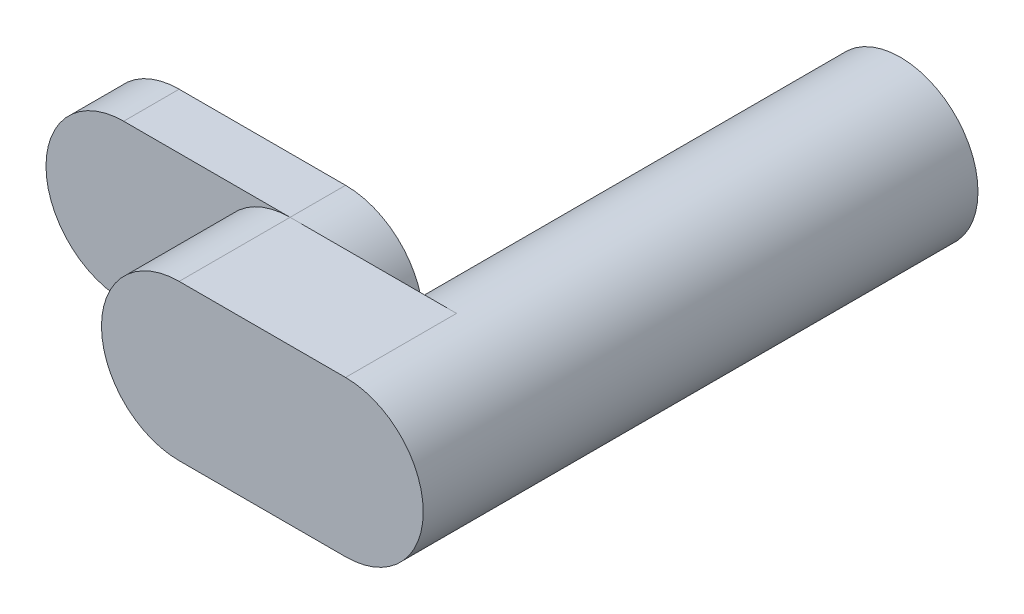
ISO-10303-21;
HEADER;
FILE_DESCRIPTION(('STEP AP214'),'2;1');
FILE_NAME('part.step','',(''),(''),'','','');
FILE_SCHEMA(('AUTOMOTIVE_DESIGN { 1 0 10303 214 1 1 1 1 }'));
ENDSEC;
DATA;
#1=APPLICATION_CONTEXT('core data for automotive mechanical design processes');
#2=APPLICATION_PROTOCOL_DEFINITION('international standard','automotive_design',2000,#1);
#3=PRODUCT_CONTEXT('',#1,'mechanical');
#4=PRODUCT('Part','Part','',(#3));
#5=PRODUCT_RELATED_PRODUCT_CATEGORY('part','',(#4));
#6=PRODUCT_DEFINITION_FORMATION('','',#4);
#7=PRODUCT_DEFINITION_CONTEXT('part definition',#1,'design');
#8=PRODUCT_DEFINITION('design','',#6,#7);
#9=PRODUCT_DEFINITION_SHAPE('','',#8);
#10=(LENGTH_UNIT() NAMED_UNIT(*) SI_UNIT(.MILLI.,.METRE.));
#11=(NAMED_UNIT(*) PLANE_ANGLE_UNIT() SI_UNIT($,.RADIAN.));
#12=(NAMED_UNIT(*) SI_UNIT($,.STERADIAN.) SOLID_ANGLE_UNIT());
#13=UNCERTAINTY_MEASURE_WITH_UNIT(LENGTH_MEASURE(1.E-05),#10,'distance_accuracy_value','');
#14=(GEOMETRIC_REPRESENTATION_CONTEXT(3) GLOBAL_UNCERTAINTY_ASSIGNED_CONTEXT((#13)) GLOBAL_UNIT_ASSIGNED_CONTEXT((#10,
#11,#12)) REPRESENTATION_CONTEXT('',''));
#15=CARTESIAN_POINT('',(0.,0.,0.));
#16=DIRECTION('',(0.,0.,1.));
#17=DIRECTION('',(1.,0.,0.));
#18=AXIS2_PLACEMENT_3D('',#15,#16,#17);
#19=CARTESIAN_POINT('',(0.,0.,400.));
#20=DIRECTION('',(0.,0.,1.));
#21=DIRECTION('',(1.,0.,0.));
#22=AXIS2_PLACEMENT_3D('',#19,#20,#21);
#23=PLANE('',#22);
#24=CARTESIAN_POINT('',(-150.,0.,400.));
#25=DIRECTION('',(0.,0.,-1.));
#26=DIRECTION('',(-1.,0.,0.));
#27=AXIS2_PLACEMENT_3D('',#24,#25,#26);
#28=CIRCLE('',#27,70.);
#29=CARTESIAN_POINT('',(-150.,70.,400.));
#30=VERTEX_POINT('',#29);
#31=CARTESIAN_POINT('',(-150.,-70.,400.));
#32=VERTEX_POINT('',#31);
#33=EDGE_CURVE('E69',#30,#32,#28,.T.);
#34=ORIENTED_EDGE('',*,*,#33,.F.);
#35=DIRECTION('',(-1.,0.,0.));
#36=VECTOR('',#35,1.);
#37=CARTESIAN_POINT('',(0.,70.,400.));
#38=LINE('',#37,#36);
#39=CARTESIAN_POINT('',(0.,70.,400.));
#40=VERTEX_POINT('',#39);
#41=EDGE_CURVE('E120',#40,#30,#38,.T.);
#42=ORIENTED_EDGE('',*,*,#41,.F.);
#43=CARTESIAN_POINT('',(0.,0.,400.));
#44=DIRECTION('',(0.,0.,1.));
#45=DIRECTION('',(1.,0.,0.));
#46=AXIS2_PLACEMENT_3D('',#43,#44,#45);
#47=CIRCLE('',#46,70.);
#48=CARTESIAN_POINT('',(0.,-70.,400.));
#49=VERTEX_POINT('',#48);
#50=EDGE_CURVE('E11',#40,#49,#47,.T.);
#51=ORIENTED_EDGE('',*,*,#50,.T.);
#52=DIRECTION('',(1.,0.,0.));
#53=VECTOR('',#52,1.);
#54=CARTESIAN_POINT('',(0.,-70.,400.));
#55=LINE('',#54,#53);
#56=EDGE_CURVE('E131',#32,#49,#55,.T.);
#57=ORIENTED_EDGE('',*,*,#56,.F.);
#58=EDGE_LOOP('',(#34,#42,#51,#57));
#59=FACE_BOUND('',#58,.T.);
#60=ADVANCED_FACE('F32',(#59),#23,.F.);
#61=CARTESIAN_POINT('',(0.,0.,400.));
#62=DIRECTION('',(0.,0.,-1.));
#63=DIRECTION('',(-1.,0.,0.));
#64=AXIS2_PLACEMENT_3D('',#61,#62,#63);
#65=CYLINDRICAL_SURFACE('',#64,70.);
#66=ORIENTED_EDGE('',*,*,#50,.F.);
#67=DIRECTION('',(0.,0.,-1.));
#68=VECTOR('',#67,1.);
#69=CARTESIAN_POINT('',(0.,70.,500.));
#70=LINE('',#69,#68);
#71=CARTESIAN_POINT('',(0.,70.,500.));
#72=VERTEX_POINT('',#71);
#73=EDGE_CURVE('E148',#72,#40,#70,.T.);
#74=ORIENTED_EDGE('',*,*,#73,.F.);
#75=CARTESIAN_POINT('',(0.,0.,500.));
#76=DIRECTION('',(0.,0.,1.));
#77=DIRECTION('',(1.,0.,0.));
#78=AXIS2_PLACEMENT_3D('',#75,#76,#77);
#79=CIRCLE('',#78,70.);
#80=CARTESIAN_POINT('',(0.,-70.,500.));
#81=VERTEX_POINT('',#80);
#82=EDGE_CURVE('E129',#81,#72,#79,.T.);
#83=ORIENTED_EDGE('',*,*,#82,.F.);
#84=DIRECTION('',(0.,0.,-1.));
#85=VECTOR('',#84,1.);
#86=CARTESIAN_POINT('',(0.,-70.,500.));
#87=LINE('',#86,#85);
#88=EDGE_CURVE('E135',#81,#49,#87,.T.);
#89=ORIENTED_EDGE('',*,*,#88,.T.);
#90=EDGE_LOOP('',(#66,#74,#83,#89));
#91=FACE_BOUND('',#90,.T.);
#92=CARTESIAN_POINT('',(0.,0.,0.));
#93=DIRECTION('',(0.,0.,1.));
#94=DIRECTION('',(1.,0.,0.));
#95=AXIS2_PLACEMENT_3D('',#92,#93,#94);
#96=CIRCLE('',#95,70.);
#97=CARTESIAN_POINT('',(70.,0.,0.));
#98=VERTEX_POINT('',#97);
#99=EDGE_CURVE('E36',#98,#98,#96,.T.);
#100=ORIENTED_EDGE('',*,*,#99,.T.);
#101=EDGE_LOOP('',(#100));
#102=FACE_BOUND('',#101,.T.);
#103=ADVANCED_FACE('F34',(#91,#102),#65,.T.);
#104=CARTESIAN_POINT('',(0.,0.,0.));
#105=DIRECTION('',(0.,0.,1.));
#106=DIRECTION('',(1.,0.,0.));
#107=AXIS2_PLACEMENT_3D('',#104,#105,#106);
#108=PLANE('',#107);
#109=ORIENTED_EDGE('',*,*,#99,.F.);
#110=EDGE_LOOP('',(#109));
#111=FACE_BOUND('',#110,.T.);
#112=ADVANCED_FACE('F154',(#111),#108,.F.);
#113=CARTESIAN_POINT('',(0.,70.,500.));
#114=DIRECTION('',(0.,-1.,0.));
#115=DIRECTION('',(1.,0.,0.));
#116=AXIS2_PLACEMENT_3D('',#113,#114,#115);
#117=PLANE('',#116);
#118=ORIENTED_EDGE('',*,*,#41,.T.);
#119=DIRECTION('',(0.,0.,-1.));
#120=VECTOR('',#119,1.);
#121=CARTESIAN_POINT('',(-150.,70.,500.));
#122=LINE('',#121,#120);
#123=CARTESIAN_POINT('',(-150.,70.,500.));
#124=VERTEX_POINT('',#123);
#125=EDGE_CURVE('E145',#124,#30,#122,.T.);
#126=ORIENTED_EDGE('',*,*,#125,.F.);
#127=DIRECTION('',(-1.,0.,0.));
#128=VECTOR('',#127,1.);
#129=CARTESIAN_POINT('',(0.,70.,500.));
#130=LINE('',#129,#128);
#131=EDGE_CURVE('E77',#72,#124,#130,.T.);
#132=ORIENTED_EDGE('',*,*,#131,.F.);
#133=ORIENTED_EDGE('',*,*,#73,.T.);
#134=EDGE_LOOP('',(#118,#126,#132,#133));
#135=FACE_BOUND('',#134,.T.);
#136=ADVANCED_FACE('F156',(#135),#117,.F.);
#137=CARTESIAN_POINT('',(-150.,0.,500.));
#138=DIRECTION('',(0.,0.,-1.));
#139=DIRECTION('',(-1.,0.,0.));
#140=AXIS2_PLACEMENT_3D('',#137,#138,#139);
#141=CYLINDRICAL_SURFACE('',#140,70.);
#142=CARTESIAN_POINT('',(-150.,0.,400.));
#143=DIRECTION('',(0.,0.,1.));
#144=DIRECTION('',(1.,0.,0.));
#145=AXIS2_PLACEMENT_3D('',#142,#143,#144);
#146=CIRCLE('',#145,70.);
#147=EDGE_CURVE('E123',#30,#32,#146,.T.);
#148=ORIENTED_EDGE('',*,*,#147,.T.);
#149=DIRECTION('',(0.,0.,-1.));
#150=VECTOR('',#149,1.);
#151=CARTESIAN_POINT('',(-150.,-70.,500.));
#152=LINE('',#151,#150);
#153=CARTESIAN_POINT('',(-150.,-70.,500.));
#154=VERTEX_POINT('',#153);
#155=EDGE_CURVE('E142',#154,#32,#152,.T.);
#156=ORIENTED_EDGE('',*,*,#155,.F.);
#157=CARTESIAN_POINT('',(-150.,0.,500.));
#158=DIRECTION('',(0.,0.,1.));
#159=DIRECTION('',(1.,0.,0.));
#160=AXIS2_PLACEMENT_3D('',#157,#158,#159);
#161=CIRCLE('',#160,70.);
#162=EDGE_CURVE('E133',#124,#154,#161,.T.);
#163=ORIENTED_EDGE('',*,*,#162,.F.);
#164=ORIENTED_EDGE('',*,*,#125,.T.);
#165=EDGE_LOOP('',(#148,#156,#163,#164));
#166=FACE_BOUND('',#165,.T.);
#167=ADVANCED_FACE('F161',(#166),#141,.T.);
#168=CARTESIAN_POINT('',(0.,-70.,500.));
#169=DIRECTION('',(0.,1.,0.));
#170=DIRECTION('',(-1.,0.,0.));
#171=AXIS2_PLACEMENT_3D('',#168,#169,#170);
#172=PLANE('',#171);
#173=ORIENTED_EDGE('',*,*,#56,.T.);
#174=ORIENTED_EDGE('',*,*,#88,.F.);
#175=DIRECTION('',(1.,0.,0.));
#176=VECTOR('',#175,1.);
#177=CARTESIAN_POINT('',(0.,-70.,500.));
#178=LINE('',#177,#176);
#179=EDGE_CURVE('E54',#154,#81,#178,.T.);
#180=ORIENTED_EDGE('',*,*,#179,.F.);
#181=ORIENTED_EDGE('',*,*,#155,.T.);
#182=EDGE_LOOP('',(#173,#174,#180,#181));
#183=FACE_BOUND('',#182,.T.);
#184=ADVANCED_FACE('F172',(#183),#172,.F.);
#185=CARTESIAN_POINT('',(0.,0.,500.));
#186=DIRECTION('',(0.,0.,1.));
#187=DIRECTION('',(1.,0.,0.));
#188=AXIS2_PLACEMENT_3D('',#185,#186,#187);
#189=PLANE('',#188);
#190=ORIENTED_EDGE('',*,*,#82,.T.);
#191=ORIENTED_EDGE('',*,*,#131,.T.);
#192=ORIENTED_EDGE('',*,*,#162,.T.);
#193=ORIENTED_EDGE('',*,*,#179,.T.);
#194=EDGE_LOOP('',(#190,#191,#192,#193));
#195=FACE_BOUND('',#194,.T.);
#196=ADVANCED_FACE('F170',(#195),#189,.T.);
#197=CARTESIAN_POINT('',(-150.,0.,400.));
#198=DIRECTION('',(0.,0.,-1.));
#199=DIRECTION('',(-1.,0.,0.));
#200=AXIS2_PLACEMENT_3D('',#197,#198,#199);
#201=PLANE('',#200);
#202=DIRECTION('',(-1.,0.,0.));
#203=VECTOR('',#202,1.);
#204=CARTESIAN_POINT('',(-150.,-70.,400.));
#205=LINE('',#204,#203);
#206=CARTESIAN_POINT('',(-300.,-70.,400.));
#207=VERTEX_POINT('',#206);
#208=EDGE_CURVE('E185',#32,#207,#205,.T.);
#209=ORIENTED_EDGE('',*,*,#208,.F.);
#210=ORIENTED_EDGE('',*,*,#147,.F.);
#211=DIRECTION('',(1.,0.,0.));
#212=VECTOR('',#211,1.);
#213=CARTESIAN_POINT('',(-150.,70.,400.));
#214=LINE('',#213,#212);
#215=CARTESIAN_POINT('',(-300.,70.,400.));
#216=VERTEX_POINT('',#215);
#217=EDGE_CURVE('E117',#216,#30,#214,.T.);
#218=ORIENTED_EDGE('',*,*,#217,.F.);
#219=CARTESIAN_POINT('',(-300.,0.,400.));
#220=DIRECTION('',(0.,0.,-1.));
#221=DIRECTION('',(-1.,0.,0.));
#222=AXIS2_PLACEMENT_3D('',#219,#220,#221);
#223=CIRCLE('',#222,70.);
#224=EDGE_CURVE('E282',#207,#216,#223,.T.);
#225=ORIENTED_EDGE('',*,*,#224,.F.);
#226=EDGE_LOOP('',(#209,#210,#218,#225));
#227=FACE_BOUND('',#226,.T.);
#228=ADVANCED_FACE('F189',(#227),#201,.F.);
#229=CARTESIAN_POINT('',(-150.,0.,350.));
#230=DIRECTION('',(0.,0.,1.));
#231=DIRECTION('',(1.,0.,0.));
#232=AXIS2_PLACEMENT_3D('',#229,#230,#231);
#233=CYLINDRICAL_SURFACE('',#232,70.);
#234=ORIENTED_EDGE('',*,*,#33,.T.);
#235=DIRECTION('',(0.,0.,1.));
#236=VECTOR('',#235,1.);
#237=CARTESIAN_POINT('',(-150.,-70.,350.));
#238=LINE('',#237,#236);
#239=CARTESIAN_POINT('',(-150.,-70.,350.));
#240=VERTEX_POINT('',#239);
#241=EDGE_CURVE('E103',#240,#32,#238,.T.);
#242=ORIENTED_EDGE('',*,*,#241,.F.);
#243=CARTESIAN_POINT('',(-150.,0.,350.));
#244=DIRECTION('',(0.,0.,-1.));
#245=DIRECTION('',(-1.,0.,0.));
#246=AXIS2_PLACEMENT_3D('',#243,#244,#245);
#247=CIRCLE('',#246,70.);
#248=CARTESIAN_POINT('',(-150.,70.,350.));
#249=VERTEX_POINT('',#248);
#250=EDGE_CURVE('E110',#249,#240,#247,.T.);
#251=ORIENTED_EDGE('',*,*,#250,.F.);
#252=DIRECTION('',(0.,0.,1.));
#253=VECTOR('',#252,1.);
#254=CARTESIAN_POINT('',(-150.,70.,350.));
#255=LINE('',#254,#253);
#256=EDGE_CURVE('E285',#249,#30,#255,.T.);
#257=ORIENTED_EDGE('',*,*,#256,.T.);
#258=EDGE_LOOP('',(#234,#242,#251,#257));
#259=FACE_BOUND('',#258,.T.);
#260=ADVANCED_FACE('F119',(#259),#233,.T.);
#261=CARTESIAN_POINT('',(-150.,-70.,350.));
#262=DIRECTION('',(0.,1.,0.));
#263=DIRECTION('',(-1.,0.,0.));
#264=AXIS2_PLACEMENT_3D('',#261,#262,#263);
#265=PLANE('',#264);
#266=ORIENTED_EDGE('',*,*,#208,.T.);
#267=DIRECTION('',(0.,0.,1.));
#268=VECTOR('',#267,1.);
#269=CARTESIAN_POINT('',(-300.,-70.,350.));
#270=LINE('',#269,#268);
#271=CARTESIAN_POINT('',(-300.,-70.,350.));
#272=VERTEX_POINT('',#271);
#273=EDGE_CURVE('E106',#272,#207,#270,.T.);
#274=ORIENTED_EDGE('',*,*,#273,.F.);
#275=DIRECTION('',(-1.,0.,0.));
#276=VECTOR('',#275,1.);
#277=CARTESIAN_POINT('',(-150.,-70.,350.));
#278=LINE('',#277,#276);
#279=EDGE_CURVE('E100',#240,#272,#278,.T.);
#280=ORIENTED_EDGE('',*,*,#279,.F.);
#281=ORIENTED_EDGE('',*,*,#241,.T.);
#282=EDGE_LOOP('',(#266,#274,#280,#281));
#283=FACE_BOUND('',#282,.T.);
#284=ADVANCED_FACE('F102',(#283),#265,.F.);
#285=CARTESIAN_POINT('',(-300.,0.,350.));
#286=DIRECTION('',(0.,0.,1.));
#287=DIRECTION('',(1.,0.,0.));
#288=AXIS2_PLACEMENT_3D('',#285,#286,#287);
#289=CYLINDRICAL_SURFACE('',#288,70.);
#290=ORIENTED_EDGE('',*,*,#224,.T.);
#291=DIRECTION('',(0.,0.,1.));
#292=VECTOR('',#291,1.);
#293=CARTESIAN_POINT('',(-300.,70.,350.));
#294=LINE('',#293,#292);
#295=CARTESIAN_POINT('',(-300.,70.,350.));
#296=VERTEX_POINT('',#295);
#297=EDGE_CURVE('E125',#296,#216,#294,.T.);
#298=ORIENTED_EDGE('',*,*,#297,.F.);
#299=CARTESIAN_POINT('',(-300.,0.,350.));
#300=DIRECTION('',(0.,0.,-1.));
#301=DIRECTION('',(-1.,0.,0.));
#302=AXIS2_PLACEMENT_3D('',#299,#300,#301);
#303=CIRCLE('',#302,70.);
#304=EDGE_CURVE('E109',#272,#296,#303,.T.);
#305=ORIENTED_EDGE('',*,*,#304,.F.);
#306=ORIENTED_EDGE('',*,*,#273,.T.);
#307=EDGE_LOOP('',(#290,#298,#305,#306));
#308=FACE_BOUND('',#307,.T.);
#309=ADVANCED_FACE('F202',(#308),#289,.T.);
#310=CARTESIAN_POINT('',(-150.,70.,350.));
#311=DIRECTION('',(0.,-1.,0.));
#312=DIRECTION('',(1.,0.,0.));
#313=AXIS2_PLACEMENT_3D('',#310,#311,#312);
#314=PLANE('',#313);
#315=ORIENTED_EDGE('',*,*,#217,.T.);
#316=ORIENTED_EDGE('',*,*,#256,.F.);
#317=DIRECTION('',(1.,0.,0.));
#318=VECTOR('',#317,1.);
#319=CARTESIAN_POINT('',(-150.,70.,350.));
#320=LINE('',#319,#318);
#321=EDGE_CURVE('E115',#296,#249,#320,.T.);
#322=ORIENTED_EDGE('',*,*,#321,.F.);
#323=ORIENTED_EDGE('',*,*,#297,.T.);
#324=EDGE_LOOP('',(#315,#316,#322,#323));
#325=FACE_BOUND('',#324,.T.);
#326=ADVANCED_FACE('F199',(#325),#314,.F.);
#327=CARTESIAN_POINT('',(-150.,0.,350.));
#328=DIRECTION('',(0.,0.,-1.));
#329=DIRECTION('',(-1.,0.,0.));
#330=AXIS2_PLACEMENT_3D('',#327,#328,#329);
#331=PLANE('',#330);
#332=ORIENTED_EDGE('',*,*,#250,.T.);
#333=ORIENTED_EDGE('',*,*,#279,.T.);
#334=ORIENTED_EDGE('',*,*,#304,.T.);
#335=ORIENTED_EDGE('',*,*,#321,.T.);
#336=EDGE_LOOP('',(#332,#333,#334,#335));
#337=FACE_BOUND('',#336,.T.);
#338=ADVANCED_FACE('F113',(#337),#331,.T.);
#339=CLOSED_SHELL('',(#60,#103,#112,#136,#167,#184,#196,#228,#260,#284,#309,#326,#338));
#340=MANIFOLD_SOLID_BREP('B2',#339);
#341=ADVANCED_BREP_SHAPE_REPRESENTATION('',(#18,#340),#14);
#342=SHAPE_DEFINITION_REPRESENTATION(#9,#341);
ENDSEC;
END-ISO-10303-21;
